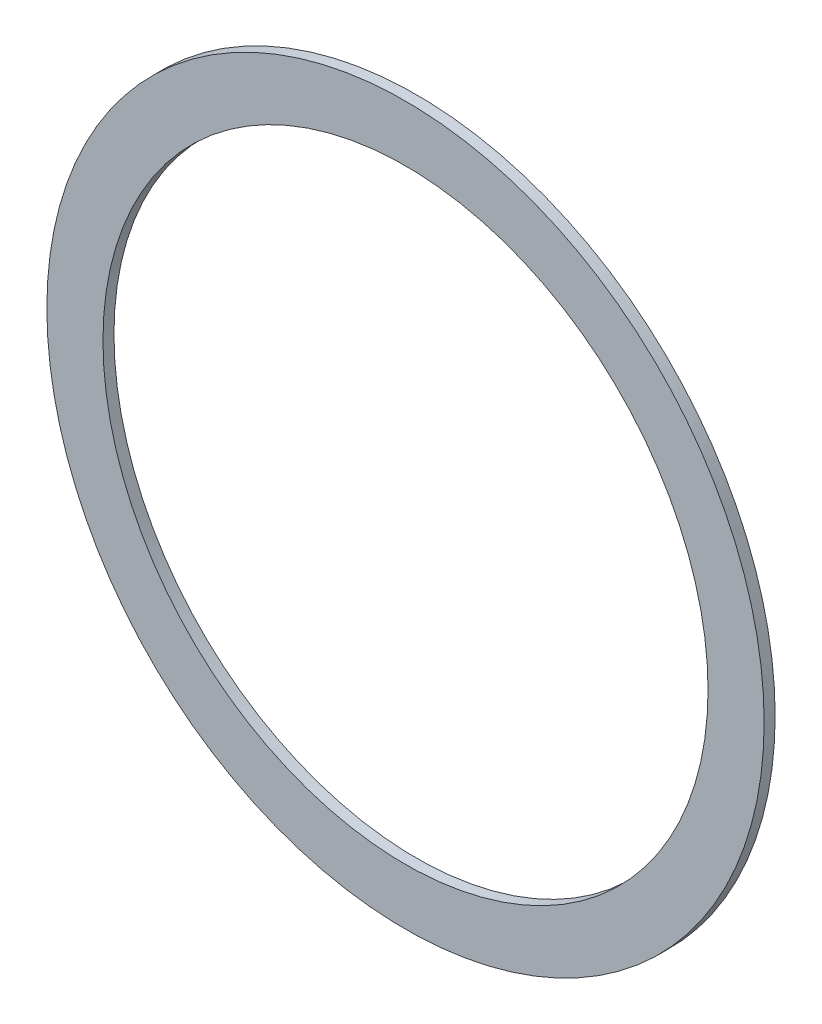
ISO-10303-21;
HEADER;
FILE_DESCRIPTION(('STEP AP214'),'2;1');
FILE_NAME('part.step','',(''),(''),'','','');
FILE_SCHEMA(('AUTOMOTIVE_DESIGN { 1 0 10303 214 1 1 1 1 }'));
ENDSEC;
DATA;
#1=APPLICATION_CONTEXT('core data for automotive mechanical design processes');
#2=APPLICATION_PROTOCOL_DEFINITION('international standard','automotive_design',2000,#1);
#3=PRODUCT_CONTEXT('',#1,'mechanical');
#4=PRODUCT('Part','Part','',(#3));
#5=PRODUCT_RELATED_PRODUCT_CATEGORY('part','',(#4));
#6=PRODUCT_DEFINITION_FORMATION('','',#4);
#7=PRODUCT_DEFINITION_CONTEXT('part definition',#1,'design');
#8=PRODUCT_DEFINITION('design','',#6,#7);
#9=PRODUCT_DEFINITION_SHAPE('','',#8);
#10=(LENGTH_UNIT() NAMED_UNIT(*) SI_UNIT(.MILLI.,.METRE.));
#11=(NAMED_UNIT(*) PLANE_ANGLE_UNIT() SI_UNIT($,.RADIAN.));
#12=(NAMED_UNIT(*) SI_UNIT($,.STERADIAN.) SOLID_ANGLE_UNIT());
#13=UNCERTAINTY_MEASURE_WITH_UNIT(LENGTH_MEASURE(1.E-05),#10,'distance_accuracy_value','');
#14=(GEOMETRIC_REPRESENTATION_CONTEXT(3) GLOBAL_UNCERTAINTY_ASSIGNED_CONTEXT((#13)) GLOBAL_UNIT_ASSIGNED_CONTEXT((#10,
#11,#12)) REPRESENTATION_CONTEXT('',''));
#15=CARTESIAN_POINT('',(0.,0.,0.));
#16=DIRECTION('',(0.,0.,1.));
#17=DIRECTION('',(1.,0.,0.));
#18=AXIS2_PLACEMENT_3D('',#15,#16,#17);
#19=CARTESIAN_POINT('',(0.,0.,0.1));
#20=DIRECTION('',(0.,0.,1.));
#21=DIRECTION('',(1.,0.,0.));
#22=AXIS2_PLACEMENT_3D('',#19,#20,#21);
#23=PLANE('',#22);
#24=CARTESIAN_POINT('',(0.,0.,0.1));
#25=DIRECTION('',(0.,0.,1.));
#26=DIRECTION('',(1.,0.,0.));
#27=AXIS2_PLACEMENT_3D('',#24,#25,#26);
#28=CIRCLE('',#27,2.75);
#29=CARTESIAN_POINT('',(2.75,0.,0.1));
#30=VERTEX_POINT('',#29);
#31=EDGE_CURVE('E10',#30,#30,#28,.T.);
#32=ORIENTED_EDGE('',*,*,#31,.F.);
#33=EDGE_LOOP('',(#32));
#34=FACE_BOUND('',#33,.T.);
#35=CARTESIAN_POINT('',(0.,0.,0.1));
#36=DIRECTION('',(0.,0.,1.));
#37=DIRECTION('',(1.,0.,0.));
#38=AXIS2_PLACEMENT_3D('',#35,#36,#37);
#39=CIRCLE('',#38,3.26);
#40=CARTESIAN_POINT('',(3.26,0.,0.1));
#41=VERTEX_POINT('',#40);
#42=EDGE_CURVE('E54',#41,#41,#39,.T.);
#43=ORIENTED_EDGE('',*,*,#42,.T.);
#44=EDGE_LOOP('',(#43));
#45=FACE_BOUND('',#44,.T.);
#46=ADVANCED_FACE('F38',(#34,#45),#23,.T.);
#47=CARTESIAN_POINT('',(0.,0.,0.));
#48=DIRECTION('',(0.,0.,1.));
#49=DIRECTION('',(1.,0.,0.));
#50=AXIS2_PLACEMENT_3D('',#47,#48,#49);
#51=PLANE('',#50);
#52=CARTESIAN_POINT('',(0.,0.,0.));
#53=DIRECTION('',(0.,0.,1.));
#54=DIRECTION('',(1.,0.,0.));
#55=AXIS2_PLACEMENT_3D('',#52,#53,#54);
#56=CIRCLE('',#55,2.75);
#57=CARTESIAN_POINT('',(2.75,0.,0.));
#58=VERTEX_POINT('',#57);
#59=EDGE_CURVE('E47',#58,#58,#56,.T.);
#60=ORIENTED_EDGE('',*,*,#59,.T.);
#61=EDGE_LOOP('',(#60));
#62=FACE_BOUND('',#61,.T.);
#63=CARTESIAN_POINT('',(0.,0.,0.));
#64=DIRECTION('',(0.,0.,1.));
#65=DIRECTION('',(1.,0.,0.));
#66=AXIS2_PLACEMENT_3D('',#63,#64,#65);
#67=CIRCLE('',#66,3.26);
#68=CARTESIAN_POINT('',(3.26,0.,0.));
#69=VERTEX_POINT('',#68);
#70=EDGE_CURVE('E42',#69,#69,#67,.T.);
#71=ORIENTED_EDGE('',*,*,#70,.F.);
#72=EDGE_LOOP('',(#71));
#73=FACE_BOUND('',#72,.T.);
#74=ADVANCED_FACE('F40',(#62,#73),#51,.F.);
#75=CARTESIAN_POINT('',(0.,0.,0.1));
#76=DIRECTION('',(0.,0.,-1.));
#77=DIRECTION('',(-1.,0.,0.));
#78=AXIS2_PLACEMENT_3D('',#75,#76,#77);
#79=CYLINDRICAL_SURFACE('',#78,2.75);
#80=ORIENTED_EDGE('',*,*,#31,.T.);
#81=EDGE_LOOP('',(#80));
#82=FACE_BOUND('',#81,.T.);
#83=ORIENTED_EDGE('',*,*,#59,.F.);
#84=EDGE_LOOP('',(#83));
#85=FACE_BOUND('',#84,.T.);
#86=ADVANCED_FACE('F66',(#82,#85),#79,.F.);
#87=CARTESIAN_POINT('',(0.,0.,-9.9));
#88=DIRECTION('',(0.,0.,1.));
#89=DIRECTION('',(1.,0.,0.));
#90=AXIS2_PLACEMENT_3D('',#87,#88,#89);
#91=CYLINDRICAL_SURFACE('',#90,3.26);
#92=ORIENTED_EDGE('',*,*,#42,.F.);
#93=EDGE_LOOP('',(#92));
#94=FACE_BOUND('',#93,.T.);
#95=ORIENTED_EDGE('',*,*,#70,.T.);
#96=EDGE_LOOP('',(#95));
#97=FACE_BOUND('',#96,.T.);
#98=ADVANCED_FACE('F63',(#94,#97),#91,.T.);
#99=CLOSED_SHELL('',(#46,#74,#86,#98));
#100=MANIFOLD_SOLID_BREP('B2',#99);
#101=ADVANCED_BREP_SHAPE_REPRESENTATION('',(#18,#100),#14);
#102=SHAPE_DEFINITION_REPRESENTATION(#9,#101);
ENDSEC;
END-ISO-10303-21;
